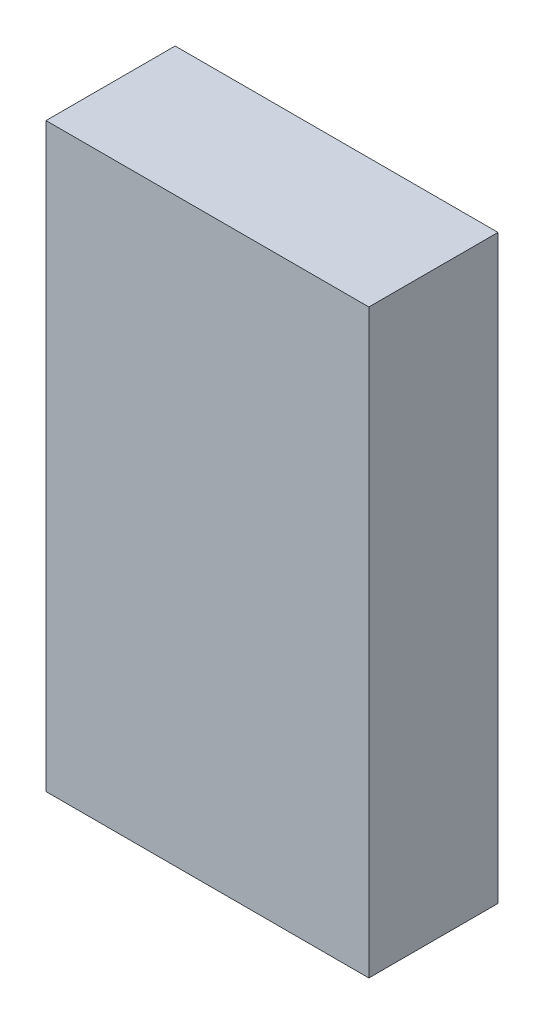
ISO-10303-21;
HEADER;
FILE_DESCRIPTION(('STEP AP214'),'2;1');
FILE_NAME('part.step','',(''),(''),'','','');
FILE_SCHEMA(('AUTOMOTIVE_DESIGN { 1 0 10303 214 1 1 1 1 }'));
ENDSEC;
DATA;
#1=APPLICATION_CONTEXT('core data for automotive mechanical design processes');
#2=APPLICATION_PROTOCOL_DEFINITION('international standard','automotive_design',2000,#1);
#3=PRODUCT_CONTEXT('',#1,'mechanical');
#4=PRODUCT('Part','Part','',(#3));
#5=PRODUCT_RELATED_PRODUCT_CATEGORY('part','',(#4));
#6=PRODUCT_DEFINITION_FORMATION('','',#4);
#7=PRODUCT_DEFINITION_CONTEXT('part definition',#1,'design');
#8=PRODUCT_DEFINITION('design','',#6,#7);
#9=PRODUCT_DEFINITION_SHAPE('','',#8);
#10=(LENGTH_UNIT() NAMED_UNIT(*) SI_UNIT(.MILLI.,.METRE.));
#11=(NAMED_UNIT(*) PLANE_ANGLE_UNIT() SI_UNIT($,.RADIAN.));
#12=(NAMED_UNIT(*) SI_UNIT($,.STERADIAN.) SOLID_ANGLE_UNIT());
#13=UNCERTAINTY_MEASURE_WITH_UNIT(LENGTH_MEASURE(1.E-05),#10,'distance_accuracy_value','');
#14=(GEOMETRIC_REPRESENTATION_CONTEXT(3) GLOBAL_UNCERTAINTY_ASSIGNED_CONTEXT((#13)) GLOBAL_UNIT_ASSIGNED_CONTEXT((#10,
#11,#12)) REPRESENTATION_CONTEXT('',''));
#15=CARTESIAN_POINT('',(0.,0.,0.));
#16=DIRECTION('',(0.,0.,1.));
#17=DIRECTION('',(1.,0.,0.));
#18=AXIS2_PLACEMENT_3D('',#15,#16,#17);
#19=CARTESIAN_POINT('',(-1.125,1.6,0.));
#20=DIRECTION('',(1.,0.,0.));
#21=DIRECTION('',(0.,0.,1.));
#22=AXIS2_PLACEMENT_3D('',#19,#20,#21);
#23=PLANE('',#22);
#24=DIRECTION('',(0.,1.,0.));
#25=VECTOR('',#24,1.);
#26=CARTESIAN_POINT('',(-1.125,1.6,0.1));
#27=LINE('',#26,#25);
#28=CARTESIAN_POINT('',(-1.125,1.6,0.1));
#29=VERTEX_POINT('',#28);
#30=CARTESIAN_POINT('',(-1.125,2.05,0.1));
#31=VERTEX_POINT('',#30);
#32=EDGE_CURVE('E11',#29,#31,#27,.T.);
#33=ORIENTED_EDGE('',*,*,#32,.T.);
#34=DIRECTION('',(0.,0.,1.));
#35=VECTOR('',#34,1.);
#36=CARTESIAN_POINT('',(-1.125,2.05,0.));
#37=LINE('',#36,#35);
#38=CARTESIAN_POINT('',(-1.125,2.05,0.));
#39=VERTEX_POINT('',#38);
#40=EDGE_CURVE('E24',#39,#31,#37,.T.);
#41=ORIENTED_EDGE('',*,*,#40,.F.);
#42=DIRECTION('',(0.,1.,0.));
#43=VECTOR('',#42,1.);
#44=CARTESIAN_POINT('',(-1.125,1.6,0.));
#45=LINE('',#44,#43);
#46=CARTESIAN_POINT('',(-1.125,1.6,0.));
#47=VERTEX_POINT('',#46);
#48=EDGE_CURVE('E86',#47,#39,#45,.T.);
#49=ORIENTED_EDGE('',*,*,#48,.F.);
#50=DIRECTION('',(0.,0.,1.));
#51=VECTOR('',#50,1.);
#52=CARTESIAN_POINT('',(-1.125,1.6,0.));
#53=LINE('',#52,#51);
#54=EDGE_CURVE('E36',#47,#29,#53,.T.);
#55=ORIENTED_EDGE('',*,*,#54,.T.);
#56=EDGE_LOOP('',(#33,#41,#49,#55));
#57=FACE_BOUND('',#56,.T.);
#58=ADVANCED_FACE('F17',(#57),#23,.F.);
#59=CARTESIAN_POINT('',(-0.875,1.6,0.));
#60=DIRECTION('',(1.,0.,0.));
#61=DIRECTION('',(0.,0.,1.));
#62=AXIS2_PLACEMENT_3D('',#59,#60,#61);
#63=PLANE('',#62);
#64=DIRECTION('',(0.,0.,1.));
#65=VECTOR('',#64,1.);
#66=CARTESIAN_POINT('',(-0.875,1.6,0.));
#67=LINE('',#66,#65);
#68=CARTESIAN_POINT('',(-0.875,1.6,0.));
#69=VERTEX_POINT('',#68);
#70=CARTESIAN_POINT('',(-0.875,1.6,0.1));
#71=VERTEX_POINT('',#70);
#72=EDGE_CURVE('E83',#69,#71,#67,.T.);
#73=ORIENTED_EDGE('',*,*,#72,.F.);
#74=DIRECTION('',(0.,1.,0.));
#75=VECTOR('',#74,1.);
#76=CARTESIAN_POINT('',(-0.875,1.6,0.));
#77=LINE('',#76,#75);
#78=CARTESIAN_POINT('',(-0.875,2.05,0.));
#79=VERTEX_POINT('',#78);
#80=EDGE_CURVE('E63',#69,#79,#77,.T.);
#81=ORIENTED_EDGE('',*,*,#80,.T.);
#82=DIRECTION('',(0.,0.,1.));
#83=VECTOR('',#82,1.);
#84=CARTESIAN_POINT('',(-0.875,2.05,0.));
#85=LINE('',#84,#83);
#86=CARTESIAN_POINT('',(-0.875,2.05,0.1));
#87=VERTEX_POINT('',#86);
#88=EDGE_CURVE('E57',#79,#87,#85,.T.);
#89=ORIENTED_EDGE('',*,*,#88,.T.);
#90=DIRECTION('',(0.,1.,0.));
#91=VECTOR('',#90,1.);
#92=CARTESIAN_POINT('',(-0.875,1.6,0.1));
#93=LINE('',#92,#91);
#94=EDGE_CURVE('E60',#71,#87,#93,.T.);
#95=ORIENTED_EDGE('',*,*,#94,.F.);
#96=EDGE_LOOP('',(#73,#81,#89,#95));
#97=FACE_BOUND('',#96,.T.);
#98=ADVANCED_FACE('F59',(#97),#63,.T.);
#99=CARTESIAN_POINT('',(-1.125,1.6,0.));
#100=DIRECTION('',(0.,1.,0.));
#101=DIRECTION('',(0.,0.,1.));
#102=AXIS2_PLACEMENT_3D('',#99,#100,#101);
#103=PLANE('',#102);
#104=ORIENTED_EDGE('',*,*,#72,.T.);
#105=DIRECTION('',(1.,0.,0.));
#106=VECTOR('',#105,1.);
#107=CARTESIAN_POINT('',(-1.125,1.6,0.1));
#108=LINE('',#107,#106);
#109=EDGE_CURVE('E71',#29,#71,#108,.T.);
#110=ORIENTED_EDGE('',*,*,#109,.F.);
#111=ORIENTED_EDGE('',*,*,#54,.F.);
#112=DIRECTION('',(1.,0.,0.));
#113=VECTOR('',#112,1.);
#114=CARTESIAN_POINT('',(-1.125,1.6,0.));
#115=LINE('',#114,#113);
#116=EDGE_CURVE('E76',#47,#69,#115,.T.);
#117=ORIENTED_EDGE('',*,*,#116,.T.);
#118=EDGE_LOOP('',(#104,#110,#111,#117));
#119=FACE_BOUND('',#118,.T.);
#120=ADVANCED_FACE('F91',(#119),#103,.F.);
#121=CARTESIAN_POINT('',(-1.125,2.05,0.));
#122=DIRECTION('',(0.,1.,0.));
#123=DIRECTION('',(0.,0.,1.));
#124=AXIS2_PLACEMENT_3D('',#121,#122,#123);
#125=PLANE('',#124);
#126=DIRECTION('',(1.,0.,0.));
#127=VECTOR('',#126,1.);
#128=CARTESIAN_POINT('',(-1.125,2.05,0.));
#129=LINE('',#128,#127);
#130=EDGE_CURVE('E74',#39,#79,#129,.T.);
#131=ORIENTED_EDGE('',*,*,#130,.F.);
#132=ORIENTED_EDGE('',*,*,#40,.T.);
#133=DIRECTION('',(1.,0.,0.));
#134=VECTOR('',#133,1.);
#135=CARTESIAN_POINT('',(-1.125,2.05,0.1));
#136=LINE('',#135,#134);
#137=EDGE_CURVE('E69',#31,#87,#136,.T.);
#138=ORIENTED_EDGE('',*,*,#137,.T.);
#139=ORIENTED_EDGE('',*,*,#88,.F.);
#140=EDGE_LOOP('',(#131,#132,#138,#139));
#141=FACE_BOUND('',#140,.T.);
#142=ADVANCED_FACE('F73',(#141),#125,.T.);
#143=CARTESIAN_POINT('',(-1.125,1.6,0.));
#144=DIRECTION('',(0.,0.,1.));
#145=DIRECTION('',(1.,0.,0.));
#146=AXIS2_PLACEMENT_3D('',#143,#144,#145);
#147=PLANE('',#146);
#148=ORIENTED_EDGE('',*,*,#130,.T.);
#149=ORIENTED_EDGE('',*,*,#80,.F.);
#150=ORIENTED_EDGE('',*,*,#116,.F.);
#151=ORIENTED_EDGE('',*,*,#48,.T.);
#152=EDGE_LOOP('',(#148,#149,#150,#151));
#153=FACE_BOUND('',#152,.T.);
#154=ADVANCED_FACE('F89',(#153),#147,.F.);
#155=CARTESIAN_POINT('',(-1.125,1.6,0.1));
#156=DIRECTION('',(0.,0.,1.));
#157=DIRECTION('',(1.,0.,0.));
#158=AXIS2_PLACEMENT_3D('',#155,#156,#157);
#159=PLANE('',#158);
#160=ORIENTED_EDGE('',*,*,#32,.F.);
#161=ORIENTED_EDGE('',*,*,#109,.T.);
#162=ORIENTED_EDGE('',*,*,#94,.T.);
#163=ORIENTED_EDGE('',*,*,#137,.F.);
#164=EDGE_LOOP('',(#160,#161,#162,#163));
#165=FACE_BOUND('',#164,.T.);
#166=ADVANCED_FACE('F68',(#165),#159,.T.);
#167=CLOSED_SHELL('',(#58,#98,#120,#142,#154,#166));
#168=MANIFOLD_SOLID_BREP('B1',#167);
#169=ADVANCED_BREP_SHAPE_REPRESENTATION('',(#18,#168),#14);
#170=SHAPE_DEFINITION_REPRESENTATION(#9,#169);
ENDSEC;
END-ISO-10303-21;
